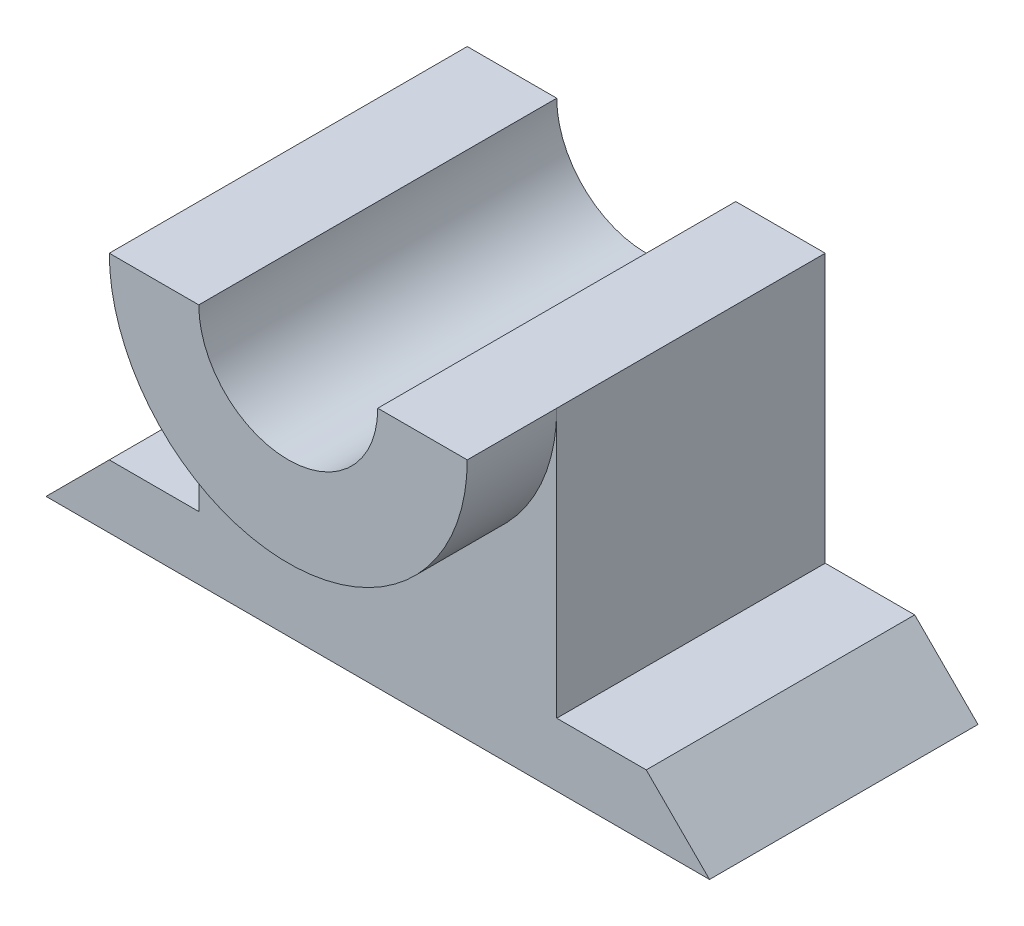
ISO-10303-21;
HEADER;
FILE_DESCRIPTION(('STEP AP214'),'2;1');
FILE_NAME('part.step','',(''),(''),'','','');
FILE_SCHEMA(('AUTOMOTIVE_DESIGN { 1 0 10303 214 1 1 1 1 }'));
ENDSEC;
DATA;
#1=APPLICATION_CONTEXT('core data for automotive mechanical design processes');
#2=APPLICATION_PROTOCOL_DEFINITION('international standard','automotive_design',2000,#1);
#3=PRODUCT_CONTEXT('',#1,'mechanical');
#4=PRODUCT('Part','Part','',(#3));
#5=PRODUCT_RELATED_PRODUCT_CATEGORY('part','',(#4));
#6=PRODUCT_DEFINITION_FORMATION('','',#4);
#7=PRODUCT_DEFINITION_CONTEXT('part definition',#1,'design');
#8=PRODUCT_DEFINITION('design','',#6,#7);
#9=PRODUCT_DEFINITION_SHAPE('','',#8);
#10=(LENGTH_UNIT() NAMED_UNIT(*) SI_UNIT(.MILLI.,.METRE.));
#11=(NAMED_UNIT(*) PLANE_ANGLE_UNIT() SI_UNIT($,.RADIAN.));
#12=(NAMED_UNIT(*) SI_UNIT($,.STERADIAN.) SOLID_ANGLE_UNIT());
#13=UNCERTAINTY_MEASURE_WITH_UNIT(LENGTH_MEASURE(1.E-05),#10,'distance_accuracy_value','');
#14=(GEOMETRIC_REPRESENTATION_CONTEXT(3) GLOBAL_UNCERTAINTY_ASSIGNED_CONTEXT((#13)) GLOBAL_UNIT_ASSIGNED_CONTEXT((#10,
#11,#12)) REPRESENTATION_CONTEXT('',''));
#15=CARTESIAN_POINT('',(0.,0.,0.));
#16=DIRECTION('',(0.,0.,1.));
#17=DIRECTION('',(1.,0.,0.));
#18=AXIS2_PLACEMENT_3D('',#15,#16,#17);
#19=CARTESIAN_POINT('',(0.,30.,30.));
#20=DIRECTION('',(0.,-1.,0.));
#21=DIRECTION('',(1.,0.,0.));
#22=AXIS2_PLACEMENT_3D('',#19,#20,#21);
#23=PLANE('',#22);
#24=DIRECTION('',(-1.,0.,0.));
#25=VECTOR('',#24,1.);
#26=CARTESIAN_POINT('',(0.,30.,0.));
#27=LINE('',#26,#25);
#28=CARTESIAN_POINT('',(40.,30.,0.));
#29=VERTEX_POINT('',#28);
#30=CARTESIAN_POINT('',(30.,30.,0.));
#31=VERTEX_POINT('',#30);
#32=EDGE_CURVE('E155',#29,#31,#27,.T.);
#33=ORIENTED_EDGE('',*,*,#32,.T.);
#34=DIRECTION('',(0.,0.,1.));
#35=VECTOR('',#34,1.);
#36=CARTESIAN_POINT('',(30.,30.,0.));
#37=LINE('',#36,#35);
#38=CARTESIAN_POINT('',(30.,30.,40.));
#39=VERTEX_POINT('',#38);
#40=EDGE_CURVE('E200',#31,#39,#37,.T.);
#41=ORIENTED_EDGE('',*,*,#40,.T.);
#42=DIRECTION('',(-1.,0.,0.));
#43=VECTOR('',#42,1.);
#44=CARTESIAN_POINT('',(0.,30.,40.));
#45=LINE('',#44,#43);
#46=CARTESIAN_POINT('',(40.,30.,40.));
#47=VERTEX_POINT('',#46);
#48=EDGE_CURVE('E193',#47,#39,#45,.T.);
#49=ORIENTED_EDGE('',*,*,#48,.F.);
#50=DIRECTION('',(0.,0.,-1.));
#51=VECTOR('',#50,1.);
#52=CARTESIAN_POINT('',(40.,30.,40.));
#53=LINE('',#52,#51);
#54=CARTESIAN_POINT('',(40.,30.,30.));
#55=VERTEX_POINT('',#54);
#56=EDGE_CURVE('E187',#47,#55,#53,.T.);
#57=ORIENTED_EDGE('',*,*,#56,.T.);
#58=DIRECTION('',(0.,0.,-1.));
#59=VECTOR('',#58,1.);
#60=CARTESIAN_POINT('',(40.,30.,30.));
#61=LINE('',#60,#59);
#62=EDGE_CURVE('E160',#55,#29,#61,.T.);
#63=ORIENTED_EDGE('',*,*,#62,.T.);
#64=EDGE_LOOP('',(#33,#41,#49,#57,#63));
#65=FACE_BOUND('',#64,.T.);
#66=ADVANCED_FACE('F33',(#65),#23,.F.);
#67=CARTESIAN_POINT('',(0.,0.,30.));
#68=DIRECTION('',(0.,0.,-1.));
#69=DIRECTION('',(-1.,0.,0.));
#70=AXIS2_PLACEMENT_3D('',#67,#68,#69);
#71=PLANE('',#70);
#72=CARTESIAN_POINT('',(20.,30.,30.));
#73=DIRECTION('',(0.,0.,-1.));
#74=DIRECTION('',(-1.,0.,0.));
#75=AXIS2_PLACEMENT_3D('',#72,#73,#74);
#76=CIRCLE('',#75,20.);
#77=CARTESIAN_POINT('',(0.,30.,30.));
#78=VERTEX_POINT('',#77);
#79=EDGE_CURVE('E144',#78,#55,#76,.F.);
#80=ORIENTED_EDGE('',*,*,#79,.F.);
#81=DIRECTION('',(0.,-1.,0.));
#82=VECTOR('',#81,1.);
#83=CARTESIAN_POINT('',(0.,0.,30.));
#84=LINE('',#83,#82);
#85=CARTESIAN_POINT('',(0.,0.,30.));
#86=VERTEX_POINT('',#85);
#87=EDGE_CURVE('E158',#78,#86,#84,.T.);
#88=ORIENTED_EDGE('',*,*,#87,.T.);
#89=DIRECTION('',(-1.,0.,0.));
#90=VECTOR('',#89,1.);
#91=CARTESIAN_POINT('',(0.,0.,30.));
#92=LINE('',#91,#90);
#93=CARTESIAN_POINT('',(-10.,0.,30.));
#94=VERTEX_POINT('',#93);
#95=EDGE_CURVE('E98',#86,#94,#92,.T.);
#96=ORIENTED_EDGE('',*,*,#95,.T.);
#97=DIRECTION('',(-0.707106781186551,-0.707106781186544,0.));
#98=VECTOR('',#97,1.);
#99=CARTESIAN_POINT('',(-10.,0.,30.));
#100=LINE('',#99,#98);
#101=CARTESIAN_POINT('',(-17.0710678118655,-7.07106781186544,30.));
#102=VERTEX_POINT('',#101);
#103=EDGE_CURVE('E173',#94,#102,#100,.T.);
#104=ORIENTED_EDGE('',*,*,#103,.T.);
#105=DIRECTION('',(1.,0.,0.));
#106=VECTOR('',#105,1.);
#107=CARTESIAN_POINT('',(-17.0710678118655,-7.07106781186544,30.));
#108=LINE('',#107,#106);
#109=CARTESIAN_POINT('',(57.0710678118655,-7.07106781186544,30.));
#110=VERTEX_POINT('',#109);
#111=EDGE_CURVE('E118',#102,#110,#108,.T.);
#112=ORIENTED_EDGE('',*,*,#111,.T.);
#113=DIRECTION('',(-0.707106781186551,0.707106781186544,0.));
#114=VECTOR('',#113,1.);
#115=CARTESIAN_POINT('',(57.0710678118655,-7.07106781186544,30.));
#116=LINE('',#115,#114);
#117=CARTESIAN_POINT('',(50.,0.,30.));
#118=VERTEX_POINT('',#117);
#119=EDGE_CURVE('E111',#110,#118,#116,.T.);
#120=ORIENTED_EDGE('',*,*,#119,.T.);
#121=DIRECTION('',(-1.,0.,0.));
#122=VECTOR('',#121,1.);
#123=CARTESIAN_POINT('',(50.,0.,30.));
#124=LINE('',#123,#122);
#125=CARTESIAN_POINT('',(40.,0.,30.));
#126=VERTEX_POINT('',#125);
#127=EDGE_CURVE('E115',#118,#126,#124,.T.);
#128=ORIENTED_EDGE('',*,*,#127,.T.);
#129=DIRECTION('',(0.,1.,0.));
#130=VECTOR('',#129,1.);
#131=CARTESIAN_POINT('',(40.,0.,30.));
#132=LINE('',#131,#130);
#133=EDGE_CURVE('E57',#126,#55,#132,.T.);
#134=ORIENTED_EDGE('',*,*,#133,.T.);
#135=EDGE_LOOP('',(#80,#88,#96,#104,#112,#120,#128,#134));
#136=FACE_BOUND('',#135,.T.);
#137=ADVANCED_FACE('F113',(#136),#71,.F.);
#138=CARTESIAN_POINT('',(0.,0.,30.));
#139=DIRECTION('',(1.,0.,0.));
#140=DIRECTION('',(0.,0.,-1.));
#141=AXIS2_PLACEMENT_3D('',#138,#139,#140);
#142=PLANE('',#141);
#143=DIRECTION('',(0.,-1.,0.));
#144=VECTOR('',#143,1.);
#145=CARTESIAN_POINT('',(0.,0.,0.));
#146=LINE('',#145,#144);
#147=CARTESIAN_POINT('',(0.,30.,0.));
#148=VERTEX_POINT('',#147);
#149=CARTESIAN_POINT('',(0.,0.,0.));
#150=VERTEX_POINT('',#149);
#151=EDGE_CURVE('E140',#148,#150,#146,.T.);
#152=ORIENTED_EDGE('',*,*,#151,.T.);
#153=DIRECTION('',(0.,0.,-1.));
#154=VECTOR('',#153,1.);
#155=CARTESIAN_POINT('',(0.,0.,30.));
#156=LINE('',#155,#154);
#157=EDGE_CURVE('E11',#86,#150,#156,.T.);
#158=ORIENTED_EDGE('',*,*,#157,.F.);
#159=ORIENTED_EDGE('',*,*,#87,.F.);
#160=DIRECTION('',(0.,0.,-1.));
#161=VECTOR('',#160,1.);
#162=CARTESIAN_POINT('',(0.,30.,30.));
#163=LINE('',#162,#161);
#164=EDGE_CURVE('E136',#78,#148,#163,.T.);
#165=ORIENTED_EDGE('',*,*,#164,.T.);
#166=EDGE_LOOP('',(#152,#158,#159,#165));
#167=FACE_BOUND('',#166,.T.);
#168=ADVANCED_FACE('F35',(#167),#142,.F.);
#169=CARTESIAN_POINT('',(0.,0.,30.));
#170=DIRECTION('',(0.,-1.,0.));
#171=DIRECTION('',(1.,0.,0.));
#172=AXIS2_PLACEMENT_3D('',#169,#170,#171);
#173=PLANE('',#172);
#174=DIRECTION('',(-1.,0.,0.));
#175=VECTOR('',#174,1.);
#176=CARTESIAN_POINT('',(0.,0.,0.));
#177=LINE('',#176,#175);
#178=CARTESIAN_POINT('',(-10.,0.,0.));
#179=VERTEX_POINT('',#178);
#180=EDGE_CURVE('E143',#150,#179,#177,.T.);
#181=ORIENTED_EDGE('',*,*,#180,.T.);
#182=DIRECTION('',(0.,0.,-1.));
#183=VECTOR('',#182,1.);
#184=CARTESIAN_POINT('',(-10.,0.,30.));
#185=LINE('',#184,#183);
#186=EDGE_CURVE('E41',#94,#179,#185,.T.);
#187=ORIENTED_EDGE('',*,*,#186,.F.);
#188=ORIENTED_EDGE('',*,*,#95,.F.);
#189=ORIENTED_EDGE('',*,*,#157,.T.);
#190=EDGE_LOOP('',(#181,#187,#188,#189));
#191=FACE_BOUND('',#190,.T.);
#192=ADVANCED_FACE('F237',(#191),#173,.F.);
#193=CARTESIAN_POINT('',(-10.,0.,30.));
#194=DIRECTION('',(0.707106781186544,-0.707106781186551,0.));
#195=DIRECTION('',(0.707106781186551,0.707106781186544,0.));
#196=AXIS2_PLACEMENT_3D('',#193,#194,#195);
#197=PLANE('',#196);
#198=DIRECTION('',(-0.707106781186551,-0.707106781186544,0.));
#199=VECTOR('',#198,1.);
#200=CARTESIAN_POINT('',(-10.,0.,0.));
#201=LINE('',#200,#199);
#202=CARTESIAN_POINT('',(-17.0710678118655,-7.07106781186544,0.));
#203=VERTEX_POINT('',#202);
#204=EDGE_CURVE('E146',#179,#203,#201,.T.);
#205=ORIENTED_EDGE('',*,*,#204,.T.);
#206=DIRECTION('',(0.,0.,-1.));
#207=VECTOR('',#206,1.);
#208=CARTESIAN_POINT('',(-17.0710678118655,-7.07106781186544,30.));
#209=LINE('',#208,#207);
#210=EDGE_CURVE('E165',#102,#203,#209,.T.);
#211=ORIENTED_EDGE('',*,*,#210,.F.);
#212=ORIENTED_EDGE('',*,*,#103,.F.);
#213=ORIENTED_EDGE('',*,*,#186,.T.);
#214=EDGE_LOOP('',(#205,#211,#212,#213));
#215=FACE_BOUND('',#214,.T.);
#216=ADVANCED_FACE('F171',(#215),#197,.F.);
#217=CARTESIAN_POINT('',(-17.0710678118655,-7.07106781186544,30.));
#218=DIRECTION('',(0.,1.,0.));
#219=DIRECTION('',(-1.,0.,0.));
#220=AXIS2_PLACEMENT_3D('',#217,#218,#219);
#221=PLANE('',#220);
#222=DIRECTION('',(1.,0.,0.));
#223=VECTOR('',#222,1.);
#224=CARTESIAN_POINT('',(-17.0710678118655,-7.07106781186544,0.));
#225=LINE('',#224,#223);
#226=CARTESIAN_POINT('',(57.0710678118655,-7.07106781186544,0.));
#227=VERTEX_POINT('',#226);
#228=EDGE_CURVE('E148',#203,#227,#225,.T.);
#229=ORIENTED_EDGE('',*,*,#228,.T.);
#230=DIRECTION('',(0.,0.,-1.));
#231=VECTOR('',#230,1.);
#232=CARTESIAN_POINT('',(57.0710678118655,-7.07106781186544,30.));
#233=LINE('',#232,#231);
#234=EDGE_CURVE('E130',#110,#227,#233,.T.);
#235=ORIENTED_EDGE('',*,*,#234,.F.);
#236=ORIENTED_EDGE('',*,*,#111,.F.);
#237=ORIENTED_EDGE('',*,*,#210,.T.);
#238=EDGE_LOOP('',(#229,#235,#236,#237));
#239=FACE_BOUND('',#238,.T.);
#240=ADVANCED_FACE('F180',(#239),#221,.F.);
#241=CARTESIAN_POINT('',(57.0710678118655,-7.07106781186544,30.));
#242=DIRECTION('',(-0.707106781186544,-0.707106781186551,0.));
#243=DIRECTION('',(0.707106781186551,-0.707106781186544,0.));
#244=AXIS2_PLACEMENT_3D('',#241,#242,#243);
#245=PLANE('',#244);
#246=DIRECTION('',(-0.707106781186551,0.707106781186544,0.));
#247=VECTOR('',#246,1.);
#248=CARTESIAN_POINT('',(57.0710678118655,-7.07106781186544,0.));
#249=LINE('',#248,#247);
#250=CARTESIAN_POINT('',(50.,0.,0.));
#251=VERTEX_POINT('',#250);
#252=EDGE_CURVE('E127',#227,#251,#249,.T.);
#253=ORIENTED_EDGE('',*,*,#252,.T.);
#254=DIRECTION('',(0.,0.,-1.));
#255=VECTOR('',#254,1.);
#256=CARTESIAN_POINT('',(50.,0.,30.));
#257=LINE('',#256,#255);
#258=EDGE_CURVE('E124',#118,#251,#257,.T.);
#259=ORIENTED_EDGE('',*,*,#258,.F.);
#260=ORIENTED_EDGE('',*,*,#119,.F.);
#261=ORIENTED_EDGE('',*,*,#234,.T.);
#262=EDGE_LOOP('',(#253,#259,#260,#261));
#263=FACE_BOUND('',#262,.T.);
#264=ADVANCED_FACE('F125',(#263),#245,.F.);
#265=CARTESIAN_POINT('',(50.,0.,30.));
#266=DIRECTION('',(0.,-1.,0.));
#267=DIRECTION('',(1.,0.,0.));
#268=AXIS2_PLACEMENT_3D('',#265,#266,#267);
#269=PLANE('',#268);
#270=DIRECTION('',(-1.,0.,0.));
#271=VECTOR('',#270,1.);
#272=CARTESIAN_POINT('',(50.,0.,0.));
#273=LINE('',#272,#271);
#274=CARTESIAN_POINT('',(40.,0.,0.));
#275=VERTEX_POINT('',#274);
#276=EDGE_CURVE('E151',#251,#275,#273,.T.);
#277=ORIENTED_EDGE('',*,*,#276,.T.);
#278=DIRECTION('',(0.,0.,-1.));
#279=VECTOR('',#278,1.);
#280=CARTESIAN_POINT('',(40.,0.,30.));
#281=LINE('',#280,#279);
#282=EDGE_CURVE('E131',#126,#275,#281,.T.);
#283=ORIENTED_EDGE('',*,*,#282,.F.);
#284=ORIENTED_EDGE('',*,*,#127,.F.);
#285=ORIENTED_EDGE('',*,*,#258,.T.);
#286=EDGE_LOOP('',(#277,#283,#284,#285));
#287=FACE_BOUND('',#286,.T.);
#288=ADVANCED_FACE('F133',(#287),#269,.F.);
#289=CARTESIAN_POINT('',(40.,0.,30.));
#290=DIRECTION('',(-1.,0.,0.));
#291=DIRECTION('',(0.,0.,1.));
#292=AXIS2_PLACEMENT_3D('',#289,#290,#291);
#293=PLANE('',#292);
#294=DIRECTION('',(0.,1.,0.));
#295=VECTOR('',#294,1.);
#296=CARTESIAN_POINT('',(40.,0.,0.));
#297=LINE('',#296,#295);
#298=EDGE_CURVE('E153',#275,#29,#297,.T.);
#299=ORIENTED_EDGE('',*,*,#298,.T.);
#300=ORIENTED_EDGE('',*,*,#62,.F.);
#301=ORIENTED_EDGE('',*,*,#133,.F.);
#302=ORIENTED_EDGE('',*,*,#282,.T.);
#303=EDGE_LOOP('',(#299,#300,#301,#302));
#304=FACE_BOUND('',#303,.T.);
#305=ADVANCED_FACE('F218',(#304),#293,.F.);
#306=CARTESIAN_POINT('',(10.,30.,40.));
#307=VERTEX_POINT('',#306);
#308=CARTESIAN_POINT('',(0.,30.,40.));
#309=VERTEX_POINT('',#308);
#310=EDGE_CURVE('E196',#307,#309,#45,.T.);
#311=ORIENTED_EDGE('',*,*,#310,.F.);
#312=DIRECTION('',(0.,0.,1.));
#313=VECTOR('',#312,1.);
#314=CARTESIAN_POINT('',(10.,30.,0.));
#315=LINE('',#314,#313);
#316=CARTESIAN_POINT('',(10.,30.,0.));
#317=VERTEX_POINT('',#316);
#318=EDGE_CURVE('E48',#317,#307,#315,.T.);
#319=ORIENTED_EDGE('',*,*,#318,.F.);
#320=EDGE_CURVE('E90',#317,#148,#27,.T.);
#321=ORIENTED_EDGE('',*,*,#320,.T.);
#322=ORIENTED_EDGE('',*,*,#164,.F.);
#323=DIRECTION('',(0.,0.,-1.));
#324=VECTOR('',#323,1.);
#325=CARTESIAN_POINT('',(0.,30.,40.));
#326=LINE('',#325,#324);
#327=EDGE_CURVE('E190',#309,#78,#326,.T.);
#328=ORIENTED_EDGE('',*,*,#327,.F.);
#329=EDGE_LOOP('',(#311,#319,#321,#322,#328));
#330=FACE_BOUND('',#329,.T.);
#331=ADVANCED_FACE('F236',(#330),#23,.F.);
#332=CARTESIAN_POINT('',(0.,0.,0.));
#333=DIRECTION('',(0.,0.,-1.));
#334=DIRECTION('',(-1.,0.,0.));
#335=AXIS2_PLACEMENT_3D('',#332,#333,#334);
#336=PLANE('',#335);
#337=CARTESIAN_POINT('',(20.,30.,0.));
#338=DIRECTION('',(0.,0.,1.));
#339=DIRECTION('',(1.,0.,0.));
#340=AXIS2_PLACEMENT_3D('',#337,#338,#339);
#341=CIRCLE('',#340,10.);
#342=EDGE_CURVE('E203',#317,#31,#341,.T.);
#343=ORIENTED_EDGE('',*,*,#342,.T.);
#344=ORIENTED_EDGE('',*,*,#32,.F.);
#345=ORIENTED_EDGE('',*,*,#298,.F.);
#346=ORIENTED_EDGE('',*,*,#276,.F.);
#347=ORIENTED_EDGE('',*,*,#252,.F.);
#348=ORIENTED_EDGE('',*,*,#228,.F.);
#349=ORIENTED_EDGE('',*,*,#204,.F.);
#350=ORIENTED_EDGE('',*,*,#180,.F.);
#351=ORIENTED_EDGE('',*,*,#151,.F.);
#352=ORIENTED_EDGE('',*,*,#320,.F.);
#353=EDGE_LOOP('',(#343,#344,#345,#346,#347,#348,#349,#350,#351,#352));
#354=FACE_BOUND('',#353,.T.);
#355=ADVANCED_FACE('F177',(#354),#336,.T.);
#356=CARTESIAN_POINT('',(20.,30.,40.));
#357=DIRECTION('',(0.,0.,-1.));
#358=DIRECTION('',(-1.,0.,0.));
#359=AXIS2_PLACEMENT_3D('',#356,#357,#358);
#360=CYLINDRICAL_SURFACE('',#359,20.);
#361=ORIENTED_EDGE('',*,*,#327,.T.);
#362=ORIENTED_EDGE('',*,*,#79,.T.);
#363=ORIENTED_EDGE('',*,*,#56,.F.);
#364=CARTESIAN_POINT('',(20.,30.,40.));
#365=DIRECTION('',(0.,0.,1.));
#366=DIRECTION('',(1.,0.,0.));
#367=AXIS2_PLACEMENT_3D('',#364,#365,#366);
#368=CIRCLE('',#367,20.);
#369=EDGE_CURVE('E197',#309,#47,#368,.T.);
#370=ORIENTED_EDGE('',*,*,#369,.F.);
#371=EDGE_LOOP('',(#361,#362,#363,#370));
#372=FACE_BOUND('',#371,.T.);
#373=ADVANCED_FACE('F220',(#372),#360,.T.);
#374=CARTESIAN_POINT('',(20.,30.,40.));
#375=DIRECTION('',(0.,0.,1.));
#376=DIRECTION('',(1.,0.,0.));
#377=AXIS2_PLACEMENT_3D('',#374,#375,#376);
#378=PLANE('',#377);
#379=CARTESIAN_POINT('',(20.,30.,40.));
#380=DIRECTION('',(0.,0.,1.));
#381=DIRECTION('',(1.,0.,0.));
#382=AXIS2_PLACEMENT_3D('',#379,#380,#381);
#383=CIRCLE('',#382,10.);
#384=EDGE_CURVE('E205',#307,#39,#383,.T.);
#385=ORIENTED_EDGE('',*,*,#384,.F.);
#386=ORIENTED_EDGE('',*,*,#310,.T.);
#387=ORIENTED_EDGE('',*,*,#369,.T.);
#388=ORIENTED_EDGE('',*,*,#48,.T.);
#389=EDGE_LOOP('',(#385,#386,#387,#388));
#390=FACE_BOUND('',#389,.T.);
#391=ADVANCED_FACE('F235',(#390),#378,.T.);
#392=CARTESIAN_POINT('',(20.,30.,0.));
#393=DIRECTION('',(0.,0.,1.));
#394=DIRECTION('',(1.,0.,0.));
#395=AXIS2_PLACEMENT_3D('',#392,#393,#394);
#396=CYLINDRICAL_SURFACE('',#395,10.);
#397=ORIENTED_EDGE('',*,*,#384,.T.);
#398=ORIENTED_EDGE('',*,*,#40,.F.);
#399=ORIENTED_EDGE('',*,*,#342,.F.);
#400=ORIENTED_EDGE('',*,*,#318,.T.);
#401=EDGE_LOOP('',(#397,#398,#399,#400));
#402=FACE_BOUND('',#401,.T.);
#403=ADVANCED_FACE('F234',(#402),#396,.F.);
#404=CLOSED_SHELL('',(#66,#137,#168,#192,#216,#240,#264,#288,#305,#331,#355,#373,#391,#403));
#405=MANIFOLD_SOLID_BREP('B2',#404);
#406=ADVANCED_BREP_SHAPE_REPRESENTATION('',(#18,#405),#14);
#407=SHAPE_DEFINITION_REPRESENTATION(#9,#406);
ENDSEC;
END-ISO-10303-21;
